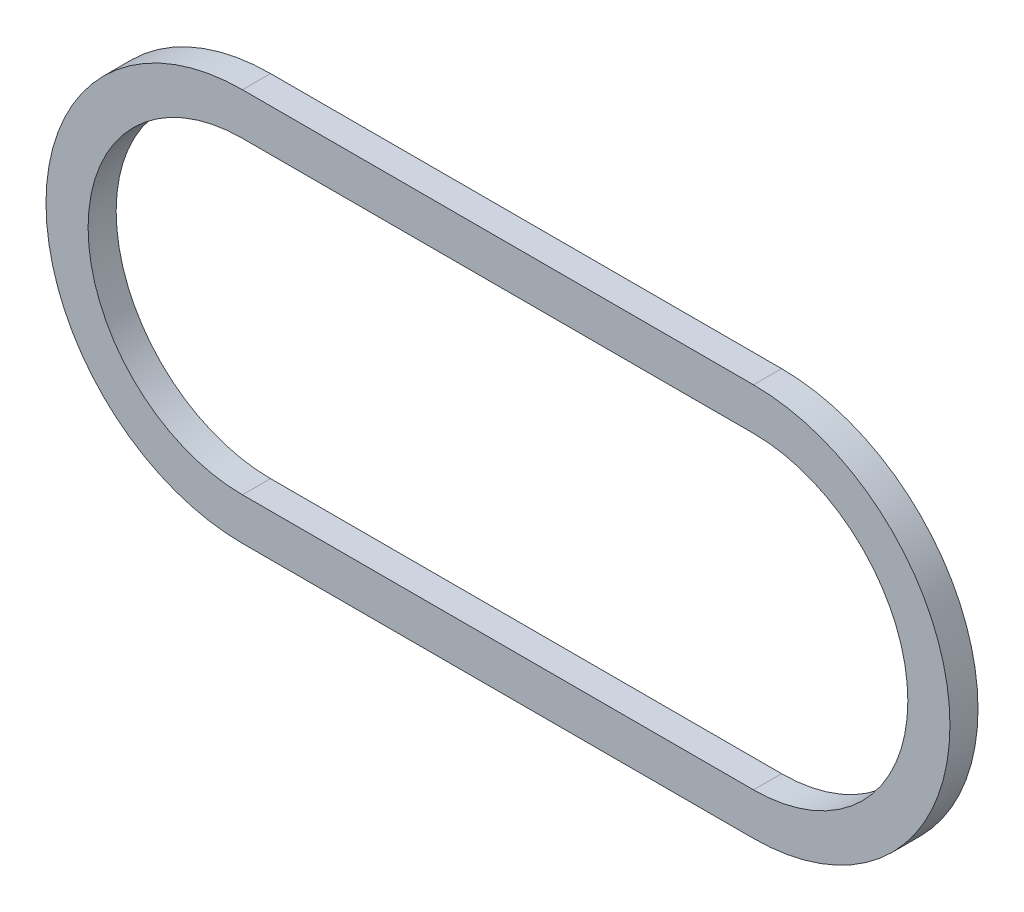
ISO-10303-21;
HEADER;
FILE_DESCRIPTION(('STEP AP214'),'2;1');
FILE_NAME('part.step','',(''),(''),'','','');
FILE_SCHEMA(('AUTOMOTIVE_DESIGN { 1 0 10303 214 1 1 1 1 }'));
ENDSEC;
DATA;
#1=APPLICATION_CONTEXT('core data for automotive mechanical design processes');
#2=APPLICATION_PROTOCOL_DEFINITION('international standard','automotive_design',2000,#1);
#3=PRODUCT_CONTEXT('',#1,'mechanical');
#4=PRODUCT('Part','Part','',(#3));
#5=PRODUCT_RELATED_PRODUCT_CATEGORY('part','',(#4));
#6=PRODUCT_DEFINITION_FORMATION('','',#4);
#7=PRODUCT_DEFINITION_CONTEXT('part definition',#1,'design');
#8=PRODUCT_DEFINITION('design','',#6,#7);
#9=PRODUCT_DEFINITION_SHAPE('','',#8);
#10=(LENGTH_UNIT() NAMED_UNIT(*) SI_UNIT(.MILLI.,.METRE.));
#11=(NAMED_UNIT(*) PLANE_ANGLE_UNIT() SI_UNIT($,.RADIAN.));
#12=(NAMED_UNIT(*) SI_UNIT($,.STERADIAN.) SOLID_ANGLE_UNIT());
#13=UNCERTAINTY_MEASURE_WITH_UNIT(LENGTH_MEASURE(1.E-05),#10,'distance_accuracy_value','');
#14=(GEOMETRIC_REPRESENTATION_CONTEXT(3) GLOBAL_UNCERTAINTY_ASSIGNED_CONTEXT((#13)) GLOBAL_UNIT_ASSIGNED_CONTEXT((#10,
#11,#12)) REPRESENTATION_CONTEXT('',''));
#15=CARTESIAN_POINT('',(0.,0.,0.));
#16=DIRECTION('',(0.,0.,1.));
#17=DIRECTION('',(1.,0.,0.));
#18=AXIS2_PLACEMENT_3D('',#15,#16,#17);
#19=CARTESIAN_POINT('',(-18.21,0.,2.));
#20=DIRECTION('',(0.,0.,1.));
#21=DIRECTION('',(1.,0.,0.));
#22=AXIS2_PLACEMENT_3D('',#19,#20,#21);
#23=PLANE('',#22);
#24=CARTESIAN_POINT('',(-18.21,0.,2.));
#25=DIRECTION('',(0.,0.,1.));
#26=DIRECTION('',(1.,0.,0.));
#27=AXIS2_PLACEMENT_3D('',#24,#25,#26);
#28=CIRCLE('',#27,14.);
#29=CARTESIAN_POINT('',(-18.21,14.,2.));
#30=VERTEX_POINT('',#29);
#31=CARTESIAN_POINT('',(-18.21,-14.,2.));
#32=VERTEX_POINT('',#31);
#33=EDGE_CURVE('E153',#30,#32,#28,.T.);
#34=ORIENTED_EDGE('',*,*,#33,.T.);
#35=DIRECTION('',(1.,0.,0.));
#36=VECTOR('',#35,1.);
#37=CARTESIAN_POINT('',(-18.21,-14.,2.));
#38=LINE('',#37,#36);
#39=CARTESIAN_POINT('',(18.21,-14.,2.));
#40=VERTEX_POINT('',#39);
#41=EDGE_CURVE('E157',#32,#40,#38,.T.);
#42=ORIENTED_EDGE('',*,*,#41,.T.);
#43=CARTESIAN_POINT('',(18.21,0.,2.));
#44=DIRECTION('',(0.,0.,1.));
#45=DIRECTION('',(1.,0.,0.));
#46=AXIS2_PLACEMENT_3D('',#43,#44,#45);
#47=CIRCLE('',#46,14.);
#48=CARTESIAN_POINT('',(18.21,14.,2.));
#49=VERTEX_POINT('',#48);
#50=EDGE_CURVE('E161',#40,#49,#47,.T.);
#51=ORIENTED_EDGE('',*,*,#50,.T.);
#52=DIRECTION('',(-1.,0.,0.));
#53=VECTOR('',#52,1.);
#54=CARTESIAN_POINT('',(-18.21,14.,2.));
#55=LINE('',#54,#53);
#56=EDGE_CURVE('E164',#49,#30,#55,.T.);
#57=ORIENTED_EDGE('',*,*,#56,.T.);
#58=EDGE_LOOP('',(#34,#42,#51,#57));
#59=FACE_BOUND('',#58,.T.);
#60=DIRECTION('',(1.,0.,0.));
#61=VECTOR('',#60,1.);
#62=CARTESIAN_POINT('',(-18.21,-11.,2.));
#63=LINE('',#62,#61);
#64=CARTESIAN_POINT('',(-18.21,-11.,2.));
#65=VERTEX_POINT('',#64);
#66=CARTESIAN_POINT('',(18.21,-11.,2.));
#67=VERTEX_POINT('',#66);
#68=EDGE_CURVE('E114',#65,#67,#63,.T.);
#69=ORIENTED_EDGE('',*,*,#68,.F.);
#70=CARTESIAN_POINT('',(-18.21,0.,2.));
#71=DIRECTION('',(0.,0.,1.));
#72=DIRECTION('',(1.,0.,0.));
#73=AXIS2_PLACEMENT_3D('',#70,#71,#72);
#74=CIRCLE('',#73,11.);
#75=CARTESIAN_POINT('',(-18.21,11.,2.));
#76=VERTEX_POINT('',#75);
#77=EDGE_CURVE('E105',#76,#65,#74,.T.);
#78=ORIENTED_EDGE('',*,*,#77,.F.);
#79=DIRECTION('',(-1.,0.,0.));
#80=VECTOR('',#79,1.);
#81=CARTESIAN_POINT('',(-18.21,11.,2.));
#82=LINE('',#81,#80);
#83=CARTESIAN_POINT('',(18.21,11.,2.));
#84=VERTEX_POINT('',#83);
#85=EDGE_CURVE('E131',#84,#76,#82,.T.);
#86=ORIENTED_EDGE('',*,*,#85,.F.);
#87=CARTESIAN_POINT('',(18.21,0.,2.));
#88=DIRECTION('',(0.,0.,1.));
#89=DIRECTION('',(1.,0.,0.));
#90=AXIS2_PLACEMENT_3D('',#87,#88,#89);
#91=CIRCLE('',#90,11.);
#92=EDGE_CURVE('E127',#67,#84,#91,.T.);
#93=ORIENTED_EDGE('',*,*,#92,.F.);
#94=EDGE_LOOP('',(#69,#78,#86,#93));
#95=FACE_BOUND('',#94,.T.);
#96=ADVANCED_FACE('F39',(#59,#95),#23,.T.);
#97=CARTESIAN_POINT('',(-18.21,0.,0.));
#98=DIRECTION('',(0.,0.,1.));
#99=DIRECTION('',(1.,0.,0.));
#100=AXIS2_PLACEMENT_3D('',#97,#98,#99);
#101=PLANE('',#100);
#102=CARTESIAN_POINT('',(-18.21,0.,0.));
#103=DIRECTION('',(0.,0.,1.));
#104=DIRECTION('',(1.,0.,0.));
#105=AXIS2_PLACEMENT_3D('',#102,#103,#104);
#106=CIRCLE('',#105,14.);
#107=CARTESIAN_POINT('',(-18.21,14.,0.));
#108=VERTEX_POINT('',#107);
#109=CARTESIAN_POINT('',(-18.21,-14.,0.));
#110=VERTEX_POINT('',#109);
#111=EDGE_CURVE('E123',#108,#110,#106,.T.);
#112=ORIENTED_EDGE('',*,*,#111,.F.);
#113=DIRECTION('',(-1.,0.,0.));
#114=VECTOR('',#113,1.);
#115=CARTESIAN_POINT('',(-18.21,14.,0.));
#116=LINE('',#115,#114);
#117=CARTESIAN_POINT('',(18.21,14.,0.));
#118=VERTEX_POINT('',#117);
#119=EDGE_CURVE('E158',#118,#108,#116,.T.);
#120=ORIENTED_EDGE('',*,*,#119,.F.);
#121=CARTESIAN_POINT('',(18.21,0.,0.));
#122=DIRECTION('',(0.,0.,1.));
#123=DIRECTION('',(1.,0.,0.));
#124=AXIS2_PLACEMENT_3D('',#121,#122,#123);
#125=CIRCLE('',#124,14.);
#126=CARTESIAN_POINT('',(18.21,-14.,0.));
#127=VERTEX_POINT('',#126);
#128=EDGE_CURVE('E174',#127,#118,#125,.T.);
#129=ORIENTED_EDGE('',*,*,#128,.F.);
#130=DIRECTION('',(1.,0.,0.));
#131=VECTOR('',#130,1.);
#132=CARTESIAN_POINT('',(-18.21,-14.,0.));
#133=LINE('',#132,#131);
#134=EDGE_CURVE('E171',#110,#127,#133,.T.);
#135=ORIENTED_EDGE('',*,*,#134,.F.);
#136=EDGE_LOOP('',(#112,#120,#129,#135));
#137=FACE_BOUND('',#136,.T.);
#138=CARTESIAN_POINT('',(-18.21,0.,0.));
#139=DIRECTION('',(0.,0.,1.));
#140=DIRECTION('',(1.,0.,0.));
#141=AXIS2_PLACEMENT_3D('',#138,#139,#140);
#142=CIRCLE('',#141,11.);
#143=CARTESIAN_POINT('',(-18.21,11.,0.));
#144=VERTEX_POINT('',#143);
#145=CARTESIAN_POINT('',(-18.21,-11.,0.));
#146=VERTEX_POINT('',#145);
#147=EDGE_CURVE('E63',#144,#146,#142,.T.);
#148=ORIENTED_EDGE('',*,*,#147,.T.);
#149=DIRECTION('',(1.,0.,0.));
#150=VECTOR('',#149,1.);
#151=CARTESIAN_POINT('',(-18.21,-11.,0.));
#152=LINE('',#151,#150);
#153=CARTESIAN_POINT('',(18.21,-11.,0.));
#154=VERTEX_POINT('',#153);
#155=EDGE_CURVE('E121',#146,#154,#152,.T.);
#156=ORIENTED_EDGE('',*,*,#155,.T.);
#157=CARTESIAN_POINT('',(18.21,0.,0.));
#158=DIRECTION('',(0.,0.,1.));
#159=DIRECTION('',(1.,0.,0.));
#160=AXIS2_PLACEMENT_3D('',#157,#158,#159);
#161=CIRCLE('',#160,11.);
#162=CARTESIAN_POINT('',(18.21,11.,0.));
#163=VERTEX_POINT('',#162);
#164=EDGE_CURVE('E140',#154,#163,#161,.T.);
#165=ORIENTED_EDGE('',*,*,#164,.T.);
#166=DIRECTION('',(-1.,0.,0.));
#167=VECTOR('',#166,1.);
#168=CARTESIAN_POINT('',(-18.21,11.,0.));
#169=LINE('',#168,#167);
#170=EDGE_CURVE('E115',#163,#144,#169,.T.);
#171=ORIENTED_EDGE('',*,*,#170,.T.);
#172=EDGE_LOOP('',(#148,#156,#165,#171));
#173=FACE_BOUND('',#172,.T.);
#174=ADVANCED_FACE('F197',(#137,#173),#101,.F.);
#175=CARTESIAN_POINT('',(-18.21,0.,2.));
#176=DIRECTION('',(0.,0.,-1.));
#177=DIRECTION('',(-1.,0.,0.));
#178=AXIS2_PLACEMENT_3D('',#175,#176,#177);
#179=CYLINDRICAL_SURFACE('',#178,14.);
#180=ORIENTED_EDGE('',*,*,#111,.T.);
#181=DIRECTION('',(0.,0.,-1.));
#182=VECTOR('',#181,1.);
#183=CARTESIAN_POINT('',(-18.21,-14.,2.));
#184=LINE('',#183,#182);
#185=EDGE_CURVE('E11',#32,#110,#184,.T.);
#186=ORIENTED_EDGE('',*,*,#185,.F.);
#187=ORIENTED_EDGE('',*,*,#33,.F.);
#188=DIRECTION('',(0.,0.,-1.));
#189=VECTOR('',#188,1.);
#190=CARTESIAN_POINT('',(-18.21,14.,2.));
#191=LINE('',#190,#189);
#192=EDGE_CURVE('E167',#30,#108,#191,.T.);
#193=ORIENTED_EDGE('',*,*,#192,.T.);
#194=EDGE_LOOP('',(#180,#186,#187,#193));
#195=FACE_BOUND('',#194,.T.);
#196=ADVANCED_FACE('F41',(#195),#179,.T.);
#197=CARTESIAN_POINT('',(-18.21,-14.,2.));
#198=DIRECTION('',(0.,1.,0.));
#199=DIRECTION('',(-1.,0.,0.));
#200=AXIS2_PLACEMENT_3D('',#197,#198,#199);
#201=PLANE('',#200);
#202=ORIENTED_EDGE('',*,*,#134,.T.);
#203=DIRECTION('',(0.,0.,-1.));
#204=VECTOR('',#203,1.);
#205=CARTESIAN_POINT('',(18.21,-14.,2.));
#206=LINE('',#205,#204);
#207=EDGE_CURVE('E48',#40,#127,#206,.T.);
#208=ORIENTED_EDGE('',*,*,#207,.F.);
#209=ORIENTED_EDGE('',*,*,#41,.F.);
#210=ORIENTED_EDGE('',*,*,#185,.T.);
#211=EDGE_LOOP('',(#202,#208,#209,#210));
#212=FACE_BOUND('',#211,.T.);
#213=ADVANCED_FACE('F207',(#212),#201,.F.);
#214=CARTESIAN_POINT('',(18.21,0.,2.));
#215=DIRECTION('',(0.,0.,-1.));
#216=DIRECTION('',(-1.,0.,0.));
#217=AXIS2_PLACEMENT_3D('',#214,#215,#216);
#218=CYLINDRICAL_SURFACE('',#217,14.);
#219=ORIENTED_EDGE('',*,*,#128,.T.);
#220=DIRECTION('',(0.,0.,-1.));
#221=VECTOR('',#220,1.);
#222=CARTESIAN_POINT('',(18.21,14.,2.));
#223=LINE('',#222,#221);
#224=EDGE_CURVE('E182',#49,#118,#223,.T.);
#225=ORIENTED_EDGE('',*,*,#224,.F.);
#226=ORIENTED_EDGE('',*,*,#50,.F.);
#227=ORIENTED_EDGE('',*,*,#207,.T.);
#228=EDGE_LOOP('',(#219,#225,#226,#227));
#229=FACE_BOUND('',#228,.T.);
#230=ADVANCED_FACE('F191',(#229),#218,.T.);
#231=CARTESIAN_POINT('',(-18.21,14.,2.));
#232=DIRECTION('',(0.,-1.,0.));
#233=DIRECTION('',(0.,0.,-1.));
#234=AXIS2_PLACEMENT_3D('',#231,#232,#233);
#235=PLANE('',#234);
#236=ORIENTED_EDGE('',*,*,#119,.T.);
#237=ORIENTED_EDGE('',*,*,#192,.F.);
#238=ORIENTED_EDGE('',*,*,#56,.F.);
#239=ORIENTED_EDGE('',*,*,#224,.T.);
#240=EDGE_LOOP('',(#236,#237,#238,#239));
#241=FACE_BOUND('',#240,.T.);
#242=ADVANCED_FACE('F201',(#241),#235,.F.);
#243=CARTESIAN_POINT('',(-18.21,0.,2.));
#244=DIRECTION('',(0.,0.,-1.));
#245=DIRECTION('',(-1.,0.,0.));
#246=AXIS2_PLACEMENT_3D('',#243,#244,#245);
#247=CYLINDRICAL_SURFACE('',#246,11.);
#248=ORIENTED_EDGE('',*,*,#147,.F.);
#249=DIRECTION('',(0.,0.,-1.));
#250=VECTOR('',#249,1.);
#251=CARTESIAN_POINT('',(-18.21,11.,2.));
#252=LINE('',#251,#250);
#253=EDGE_CURVE('E109',#76,#144,#252,.T.);
#254=ORIENTED_EDGE('',*,*,#253,.F.);
#255=ORIENTED_EDGE('',*,*,#77,.T.);
#256=DIRECTION('',(0.,0.,-1.));
#257=VECTOR('',#256,1.);
#258=CARTESIAN_POINT('',(-18.21,-11.,2.));
#259=LINE('',#258,#257);
#260=EDGE_CURVE('E108',#65,#146,#259,.T.);
#261=ORIENTED_EDGE('',*,*,#260,.T.);
#262=EDGE_LOOP('',(#248,#254,#255,#261));
#263=FACE_BOUND('',#262,.T.);
#264=ADVANCED_FACE('F107',(#263),#247,.F.);
#265=CARTESIAN_POINT('',(-18.21,-11.,2.));
#266=DIRECTION('',(0.,1.,0.));
#267=DIRECTION('',(-1.,0.,0.));
#268=AXIS2_PLACEMENT_3D('',#265,#266,#267);
#269=PLANE('',#268);
#270=ORIENTED_EDGE('',*,*,#155,.F.);
#271=ORIENTED_EDGE('',*,*,#260,.F.);
#272=ORIENTED_EDGE('',*,*,#68,.T.);
#273=DIRECTION('',(0.,0.,-1.));
#274=VECTOR('',#273,1.);
#275=CARTESIAN_POINT('',(18.21,-11.,2.));
#276=LINE('',#275,#274);
#277=EDGE_CURVE('E124',#67,#154,#276,.T.);
#278=ORIENTED_EDGE('',*,*,#277,.T.);
#279=EDGE_LOOP('',(#270,#271,#272,#278));
#280=FACE_BOUND('',#279,.T.);
#281=ADVANCED_FACE('F118',(#280),#269,.T.);
#282=CARTESIAN_POINT('',(18.21,0.,2.));
#283=DIRECTION('',(0.,0.,-1.));
#284=DIRECTION('',(-1.,0.,0.));
#285=AXIS2_PLACEMENT_3D('',#282,#283,#284);
#286=CYLINDRICAL_SURFACE('',#285,11.);
#287=ORIENTED_EDGE('',*,*,#164,.F.);
#288=ORIENTED_EDGE('',*,*,#277,.F.);
#289=ORIENTED_EDGE('',*,*,#92,.T.);
#290=DIRECTION('',(0.,0.,-1.));
#291=VECTOR('',#290,1.);
#292=CARTESIAN_POINT('',(18.21,11.,2.));
#293=LINE('',#292,#291);
#294=EDGE_CURVE('E55',#84,#163,#293,.T.);
#295=ORIENTED_EDGE('',*,*,#294,.T.);
#296=EDGE_LOOP('',(#287,#288,#289,#295));
#297=FACE_BOUND('',#296,.T.);
#298=ADVANCED_FACE('F230',(#297),#286,.F.);
#299=CARTESIAN_POINT('',(-18.21,11.,2.));
#300=DIRECTION('',(0.,-1.,0.));
#301=DIRECTION('',(1.,0.,0.));
#302=AXIS2_PLACEMENT_3D('',#299,#300,#301);
#303=PLANE('',#302);
#304=ORIENTED_EDGE('',*,*,#170,.F.);
#305=ORIENTED_EDGE('',*,*,#294,.F.);
#306=ORIENTED_EDGE('',*,*,#85,.T.);
#307=ORIENTED_EDGE('',*,*,#253,.T.);
#308=EDGE_LOOP('',(#304,#305,#306,#307));
#309=FACE_BOUND('',#308,.T.);
#310=ADVANCED_FACE('F234',(#309),#303,.T.);
#311=CLOSED_SHELL('',(#96,#174,#196,#213,#230,#242,#264,#281,#298,#310));
#312=MANIFOLD_SOLID_BREP('B2',#311);
#313=ADVANCED_BREP_SHAPE_REPRESENTATION('',(#18,#312),#14);
#314=SHAPE_DEFINITION_REPRESENTATION(#9,#313);
ENDSEC;
END-ISO-10303-21;
